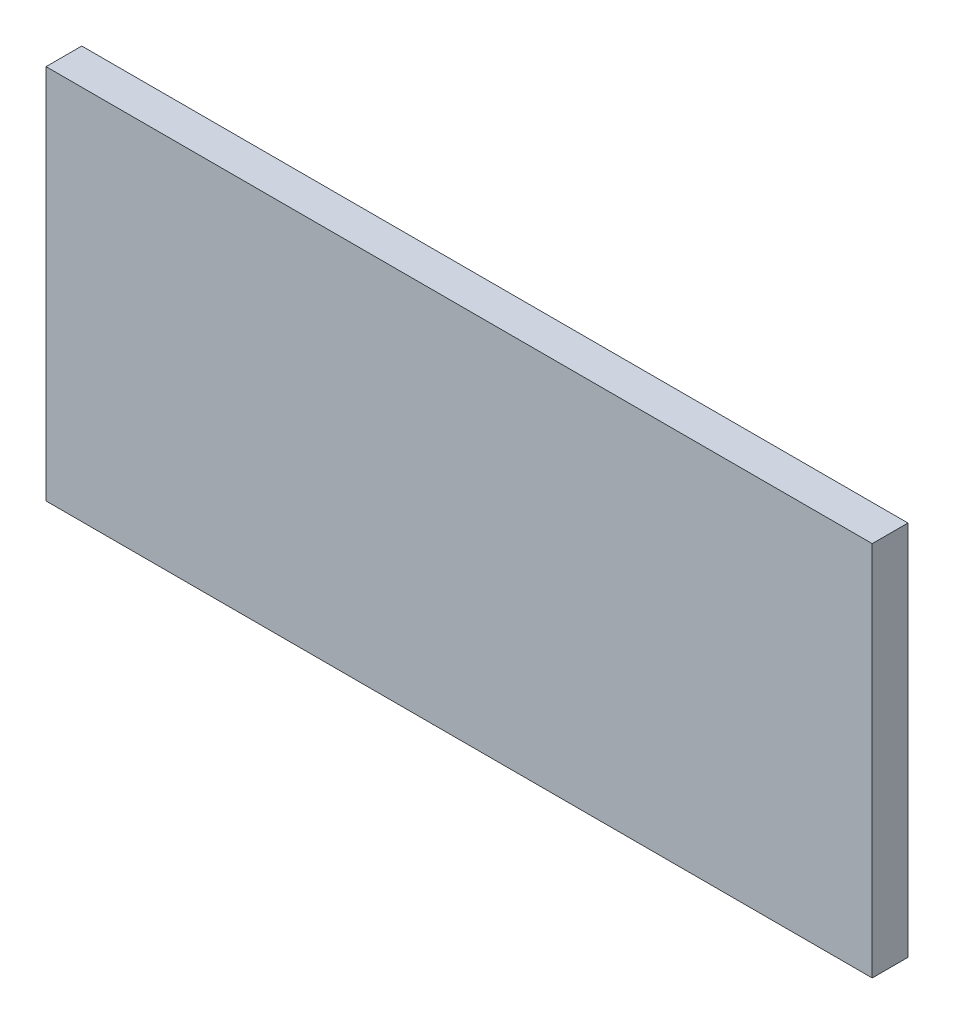
ISO-10303-21;
HEADER;
FILE_DESCRIPTION(('STEP AP214'),'2;1');
FILE_NAME('part.step','',(''),(''),'','','');
FILE_SCHEMA(('AUTOMOTIVE_DESIGN { 1 0 10303 214 1 1 1 1 }'));
ENDSEC;
DATA;
#1=APPLICATION_CONTEXT('core data for automotive mechanical design processes');
#2=APPLICATION_PROTOCOL_DEFINITION('international standard','automotive_design',2000,#1);
#3=PRODUCT_CONTEXT('',#1,'mechanical');
#4=PRODUCT('Part','Part','',(#3));
#5=PRODUCT_RELATED_PRODUCT_CATEGORY('part','',(#4));
#6=PRODUCT_DEFINITION_FORMATION('','',#4);
#7=PRODUCT_DEFINITION_CONTEXT('part definition',#1,'design');
#8=PRODUCT_DEFINITION('design','',#6,#7);
#9=PRODUCT_DEFINITION_SHAPE('','',#8);
#10=(LENGTH_UNIT() NAMED_UNIT(*) SI_UNIT(.MILLI.,.METRE.));
#11=(NAMED_UNIT(*) PLANE_ANGLE_UNIT() SI_UNIT($,.RADIAN.));
#12=(NAMED_UNIT(*) SI_UNIT($,.STERADIAN.) SOLID_ANGLE_UNIT());
#13=UNCERTAINTY_MEASURE_WITH_UNIT(LENGTH_MEASURE(1.E-05),#10,'distance_accuracy_value','');
#14=(GEOMETRIC_REPRESENTATION_CONTEXT(3) GLOBAL_UNCERTAINTY_ASSIGNED_CONTEXT((#13)) GLOBAL_UNIT_ASSIGNED_CONTEXT((#10,
#11,#12)) REPRESENTATION_CONTEXT('',''));
#15=CARTESIAN_POINT('',(0.,0.,0.));
#16=DIRECTION('',(0.,0.,1.));
#17=DIRECTION('',(1.,0.,0.));
#18=AXIS2_PLACEMENT_3D('',#15,#16,#17);
#19=CARTESIAN_POINT('',(0.,0.,-30.));
#20=DIRECTION('',(-1.,0.,0.));
#21=DIRECTION('',(0.,-1.,0.));
#22=AXIS2_PLACEMENT_3D('',#19,#20,#21);
#23=PLANE('',#22);
#24=DIRECTION('',(0.,-1.,0.));
#25=VECTOR('',#24,1.);
#26=CARTESIAN_POINT('',(0.,0.,0.));
#27=LINE('',#26,#25);
#28=CARTESIAN_POINT('',(0.,0.,0.));
#29=VERTEX_POINT('',#28);
#30=CARTESIAN_POINT('',(0.,-316.,0.));
#31=VERTEX_POINT('',#30);
#32=EDGE_CURVE('E100',#29,#31,#27,.T.);
#33=ORIENTED_EDGE('',*,*,#32,.F.);
#34=DIRECTION('',(0.,0.,1.));
#35=VECTOR('',#34,1.);
#36=CARTESIAN_POINT('',(0.,0.,-30.));
#37=LINE('',#36,#35);
#38=CARTESIAN_POINT('',(0.,0.,-30.));
#39=VERTEX_POINT('',#38);
#40=EDGE_CURVE('E11',#39,#29,#37,.T.);
#41=ORIENTED_EDGE('',*,*,#40,.F.);
#42=DIRECTION('',(0.,-1.,0.));
#43=VECTOR('',#42,1.);
#44=CARTESIAN_POINT('',(0.,0.,-30.));
#45=LINE('',#44,#43);
#46=CARTESIAN_POINT('',(0.,-316.,-30.));
#47=VERTEX_POINT('',#46);
#48=EDGE_CURVE('E94',#39,#47,#45,.T.);
#49=ORIENTED_EDGE('',*,*,#48,.T.);
#50=DIRECTION('',(0.,0.,1.));
#51=VECTOR('',#50,1.);
#52=CARTESIAN_POINT('',(0.,-316.,-30.));
#53=LINE('',#52,#51);
#54=EDGE_CURVE('E39',#47,#31,#53,.T.);
#55=ORIENTED_EDGE('',*,*,#54,.T.);
#56=EDGE_LOOP('',(#33,#41,#49,#55));
#57=FACE_BOUND('',#56,.T.);
#58=ADVANCED_FACE('F36',(#57),#23,.T.);
#59=CARTESIAN_POINT('',(0.,0.,-30.));
#60=DIRECTION('',(0.,1.,0.));
#61=DIRECTION('',(0.,0.,1.));
#62=AXIS2_PLACEMENT_3D('',#59,#60,#61);
#63=PLANE('',#62);
#64=DIRECTION('',(-1.,0.,0.));
#65=VECTOR('',#64,1.);
#66=CARTESIAN_POINT('',(0.,0.,0.));
#67=LINE('',#66,#65);
#68=CARTESIAN_POINT('',(694.,0.,0.));
#69=VERTEX_POINT('',#68);
#70=EDGE_CURVE('E96',#69,#29,#67,.T.);
#71=ORIENTED_EDGE('',*,*,#70,.F.);
#72=DIRECTION('',(0.,0.,1.));
#73=VECTOR('',#72,1.);
#74=CARTESIAN_POINT('',(694.,0.,-30.));
#75=LINE('',#74,#73);
#76=CARTESIAN_POINT('',(694.,0.,-30.));
#77=VERTEX_POINT('',#76);
#78=EDGE_CURVE('E45',#77,#69,#75,.T.);
#79=ORIENTED_EDGE('',*,*,#78,.F.);
#80=DIRECTION('',(-1.,0.,0.));
#81=VECTOR('',#80,1.);
#82=CARTESIAN_POINT('',(0.,0.,-30.));
#83=LINE('',#82,#81);
#84=EDGE_CURVE('E91',#77,#39,#83,.T.);
#85=ORIENTED_EDGE('',*,*,#84,.T.);
#86=ORIENTED_EDGE('',*,*,#40,.T.);
#87=EDGE_LOOP('',(#71,#79,#85,#86));
#88=FACE_BOUND('',#87,.T.);
#89=ADVANCED_FACE('F110',(#88),#63,.T.);
#90=CARTESIAN_POINT('',(694.,0.,-30.));
#91=DIRECTION('',(1.,0.,0.));
#92=DIRECTION('',(0.,0.,-1.));
#93=AXIS2_PLACEMENT_3D('',#90,#91,#92);
#94=PLANE('',#93);
#95=DIRECTION('',(0.,1.,0.));
#96=VECTOR('',#95,1.);
#97=CARTESIAN_POINT('',(694.,0.,0.));
#98=LINE('',#97,#96);
#99=CARTESIAN_POINT('',(694.,-316.,0.));
#100=VERTEX_POINT('',#99);
#101=EDGE_CURVE('E86',#100,#69,#98,.T.);
#102=ORIENTED_EDGE('',*,*,#101,.F.);
#103=DIRECTION('',(0.,0.,1.));
#104=VECTOR('',#103,1.);
#105=CARTESIAN_POINT('',(694.,-316.,-30.));
#106=LINE('',#105,#104);
#107=CARTESIAN_POINT('',(694.,-316.,-30.));
#108=VERTEX_POINT('',#107);
#109=EDGE_CURVE('E81',#108,#100,#106,.T.);
#110=ORIENTED_EDGE('',*,*,#109,.F.);
#111=DIRECTION('',(0.,1.,0.));
#112=VECTOR('',#111,1.);
#113=CARTESIAN_POINT('',(694.,0.,-30.));
#114=LINE('',#113,#112);
#115=EDGE_CURVE('E84',#108,#77,#114,.T.);
#116=ORIENTED_EDGE('',*,*,#115,.T.);
#117=ORIENTED_EDGE('',*,*,#78,.T.);
#118=EDGE_LOOP('',(#102,#110,#116,#117));
#119=FACE_BOUND('',#118,.T.);
#120=ADVANCED_FACE('F83',(#119),#94,.T.);
#121=CARTESIAN_POINT('',(0.,-316.,-30.));
#122=DIRECTION('',(0.,-1.,0.));
#123=DIRECTION('',(0.,0.,-1.));
#124=AXIS2_PLACEMENT_3D('',#121,#122,#123);
#125=PLANE('',#124);
#126=DIRECTION('',(1.,0.,0.));
#127=VECTOR('',#126,1.);
#128=CARTESIAN_POINT('',(0.,-316.,0.));
#129=LINE('',#128,#127);
#130=EDGE_CURVE('E103',#31,#100,#129,.T.);
#131=ORIENTED_EDGE('',*,*,#130,.F.);
#132=ORIENTED_EDGE('',*,*,#54,.F.);
#133=DIRECTION('',(1.,0.,0.));
#134=VECTOR('',#133,1.);
#135=CARTESIAN_POINT('',(0.,-316.,-30.));
#136=LINE('',#135,#134);
#137=EDGE_CURVE('E90',#47,#108,#136,.T.);
#138=ORIENTED_EDGE('',*,*,#137,.T.);
#139=ORIENTED_EDGE('',*,*,#109,.T.);
#140=EDGE_LOOP('',(#131,#132,#138,#139));
#141=FACE_BOUND('',#140,.T.);
#142=ADVANCED_FACE('F93',(#141),#125,.T.);
#143=CARTESIAN_POINT('',(0.,0.,-30.));
#144=DIRECTION('',(0.,0.,1.));
#145=DIRECTION('',(1.,0.,0.));
#146=AXIS2_PLACEMENT_3D('',#143,#144,#145);
#147=PLANE('',#146);
#148=ORIENTED_EDGE('',*,*,#48,.F.);
#149=ORIENTED_EDGE('',*,*,#84,.F.);
#150=ORIENTED_EDGE('',*,*,#115,.F.);
#151=ORIENTED_EDGE('',*,*,#137,.F.);
#152=EDGE_LOOP('',(#148,#149,#150,#151));
#153=FACE_BOUND('',#152,.T.);
#154=ADVANCED_FACE('F89',(#153),#147,.F.);
#155=CARTESIAN_POINT('',(0.,0.,0.));
#156=DIRECTION('',(0.,0.,1.));
#157=DIRECTION('',(1.,0.,0.));
#158=AXIS2_PLACEMENT_3D('',#155,#156,#157);
#159=PLANE('',#158);
#160=ORIENTED_EDGE('',*,*,#32,.T.);
#161=ORIENTED_EDGE('',*,*,#130,.T.);
#162=ORIENTED_EDGE('',*,*,#101,.T.);
#163=ORIENTED_EDGE('',*,*,#70,.T.);
#164=EDGE_LOOP('',(#160,#161,#162,#163));
#165=FACE_BOUND('',#164,.T.);
#166=ADVANCED_FACE('F109',(#165),#159,.T.);
#167=CLOSED_SHELL('',(#58,#89,#120,#142,#154,#166));
#168=MANIFOLD_SOLID_BREP('B2',#167);
#169=ADVANCED_BREP_SHAPE_REPRESENTATION('',(#18,#168),#14);
#170=SHAPE_DEFINITION_REPRESENTATION(#9,#169);
ENDSEC;
END-ISO-10303-21;
